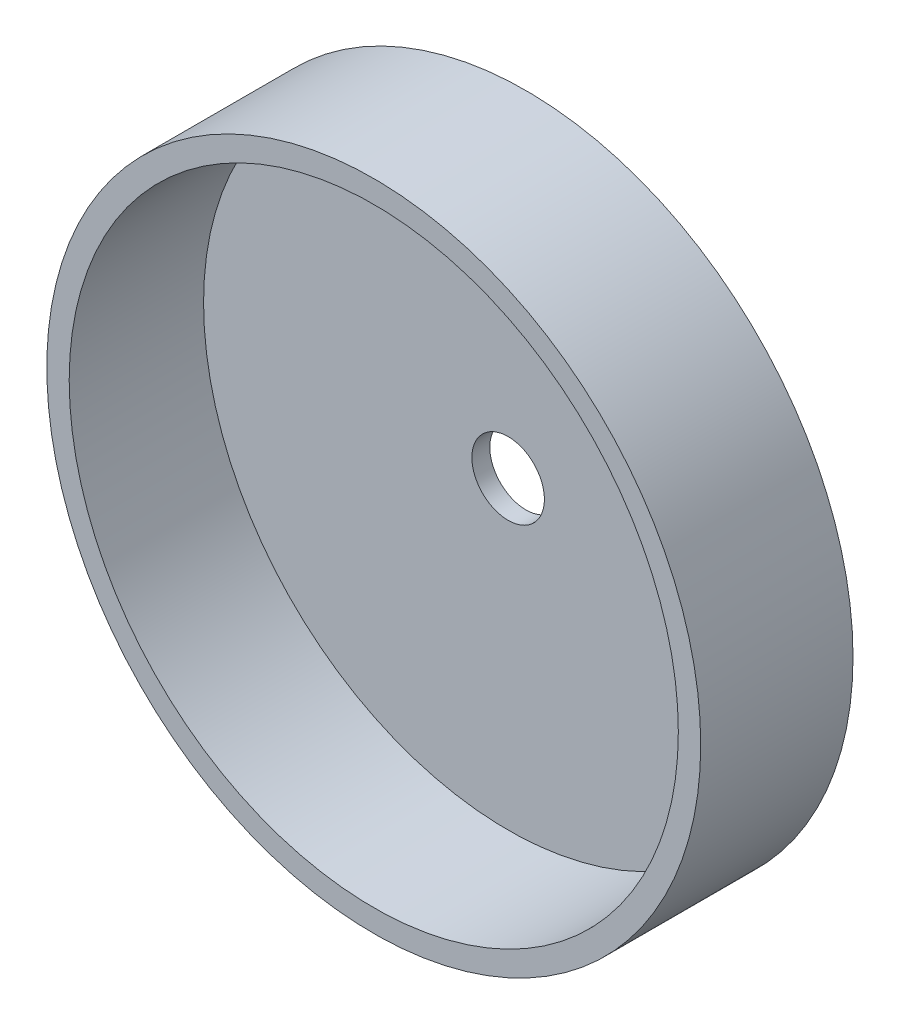
ISO-10303-21;
HEADER;
FILE_DESCRIPTION(('STEP AP214'),'2;1');
FILE_NAME('part.step','',(''),(''),'','','');
FILE_SCHEMA(('AUTOMOTIVE_DESIGN { 1 0 10303 214 1 1 1 1 }'));
ENDSEC;
DATA;
#1=APPLICATION_CONTEXT('core data for automotive mechanical design processes');
#2=APPLICATION_PROTOCOL_DEFINITION('international standard','automotive_design',2000,#1);
#3=PRODUCT_CONTEXT('',#1,'mechanical');
#4=PRODUCT('Part','Part','',(#3));
#5=PRODUCT_RELATED_PRODUCT_CATEGORY('part','',(#4));
#6=PRODUCT_DEFINITION_FORMATION('','',#4);
#7=PRODUCT_DEFINITION_CONTEXT('part definition',#1,'design');
#8=PRODUCT_DEFINITION('design','',#6,#7);
#9=PRODUCT_DEFINITION_SHAPE('','',#8);
#10=(LENGTH_UNIT() NAMED_UNIT(*) SI_UNIT(.MILLI.,.METRE.));
#11=(NAMED_UNIT(*) PLANE_ANGLE_UNIT() SI_UNIT($,.RADIAN.));
#12=(NAMED_UNIT(*) SI_UNIT($,.STERADIAN.) SOLID_ANGLE_UNIT());
#13=UNCERTAINTY_MEASURE_WITH_UNIT(LENGTH_MEASURE(1.E-05),#10,'distance_accuracy_value','');
#14=(GEOMETRIC_REPRESENTATION_CONTEXT(3) GLOBAL_UNCERTAINTY_ASSIGNED_CONTEXT((#13)) GLOBAL_UNIT_ASSIGNED_CONTEXT((#10,
#11,#12)) REPRESENTATION_CONTEXT('',''));
#15=CARTESIAN_POINT('',(0.,0.,0.));
#16=DIRECTION('',(0.,0.,1.));
#17=DIRECTION('',(1.,0.,0.));
#18=AXIS2_PLACEMENT_3D('',#15,#16,#17);
#19=CARTESIAN_POINT('',(0.,0.,2.));
#20=DIRECTION('',(0.,0.,1.));
#21=DIRECTION('',(1.,0.,0.));
#22=AXIS2_PLACEMENT_3D('',#19,#20,#21);
#23=PLANE('',#22);
#24=CARTESIAN_POINT('',(0.,0.,2.));
#25=DIRECTION('',(0.,0.,1.));
#26=DIRECTION('',(1.,0.,0.));
#27=AXIS2_PLACEMENT_3D('',#24,#25,#26);
#28=CIRCLE('',#27,4.05);
#29=CARTESIAN_POINT('',(4.05,0.,2.));
#30=VERTEX_POINT('',#29);
#31=EDGE_CURVE('E51',#30,#30,#28,.T.);
#32=ORIENTED_EDGE('',*,*,#31,.F.);
#33=EDGE_LOOP('',(#32));
#34=FACE_BOUND('',#33,.T.);
#35=CARTESIAN_POINT('',(0.,0.,2.));
#36=DIRECTION('',(0.,0.,1.));
#37=DIRECTION('',(1.,0.,0.));
#38=AXIS2_PLACEMENT_3D('',#35,#36,#37);
#39=CIRCLE('',#38,34.);
#40=CARTESIAN_POINT('',(34.,0.,2.));
#41=VERTEX_POINT('',#40);
#42=EDGE_CURVE('E10',#41,#41,#39,.T.);
#43=ORIENTED_EDGE('',*,*,#42,.T.);
#44=EDGE_LOOP('',(#43));
#45=FACE_BOUND('',#44,.T.);
#46=ADVANCED_FACE('F31',(#34,#45),#23,.T.);
#47=CARTESIAN_POINT('',(0.,0.,-103.237590053236));
#48=DIRECTION('',(0.,0.,1.));
#49=DIRECTION('',(1.,0.,0.));
#50=AXIS2_PLACEMENT_3D('',#47,#48,#49);
#51=CYLINDRICAL_SURFACE('',#50,36.5);
#52=CARTESIAN_POINT('',(0.,0.,0.));
#53=DIRECTION('',(0.,0.,1.));
#54=DIRECTION('',(1.,0.,0.));
#55=AXIS2_PLACEMENT_3D('',#52,#53,#54);
#56=CIRCLE('',#55,36.5);
#57=CARTESIAN_POINT('',(36.5,0.,0.));
#58=VERTEX_POINT('',#57);
#59=EDGE_CURVE('E38',#58,#58,#56,.F.);
#60=ORIENTED_EDGE('',*,*,#59,.F.);
#61=EDGE_LOOP('',(#60));
#62=FACE_BOUND('',#61,.T.);
#63=CARTESIAN_POINT('',(0.,0.,17.));
#64=DIRECTION('',(0.,0.,1.));
#65=DIRECTION('',(1.,0.,0.));
#66=AXIS2_PLACEMENT_3D('',#63,#64,#65);
#67=CIRCLE('',#66,36.5);
#68=CARTESIAN_POINT('',(36.5,0.,17.));
#69=VERTEX_POINT('',#68);
#70=EDGE_CURVE('E42',#69,#69,#67,.T.);
#71=ORIENTED_EDGE('',*,*,#70,.F.);
#72=EDGE_LOOP('',(#71));
#73=FACE_BOUND('',#72,.T.);
#74=ADVANCED_FACE('F70',(#62,#73),#51,.T.);
#75=CARTESIAN_POINT('',(0.,0.,-103.237590053236));
#76=DIRECTION('',(0.,0.,1.));
#77=DIRECTION('',(1.,0.,0.));
#78=AXIS2_PLACEMENT_3D('',#75,#76,#77);
#79=CYLINDRICAL_SURFACE('',#78,34.);
#80=ORIENTED_EDGE('',*,*,#42,.F.);
#81=EDGE_LOOP('',(#80));
#82=FACE_BOUND('',#81,.T.);
#83=CARTESIAN_POINT('',(0.,0.,17.));
#84=DIRECTION('',(0.,0.,1.));
#85=DIRECTION('',(1.,0.,0.));
#86=AXIS2_PLACEMENT_3D('',#83,#84,#85);
#87=CIRCLE('',#86,34.);
#88=CARTESIAN_POINT('',(34.,0.,17.));
#89=VERTEX_POINT('',#88);
#90=EDGE_CURVE('E46',#89,#89,#87,.T.);
#91=ORIENTED_EDGE('',*,*,#90,.T.);
#92=EDGE_LOOP('',(#91));
#93=FACE_BOUND('',#92,.T.);
#94=ADVANCED_FACE('F76',(#82,#93),#79,.F.);
#95=CARTESIAN_POINT('',(0.,0.,17.));
#96=DIRECTION('',(0.,0.,1.));
#97=DIRECTION('',(1.,0.,0.));
#98=AXIS2_PLACEMENT_3D('',#95,#96,#97);
#99=PLANE('',#98);
#100=ORIENTED_EDGE('',*,*,#70,.T.);
#101=EDGE_LOOP('',(#100));
#102=FACE_BOUND('',#101,.T.);
#103=ORIENTED_EDGE('',*,*,#90,.F.);
#104=EDGE_LOOP('',(#103));
#105=FACE_BOUND('',#104,.T.);
#106=ADVANCED_FACE('F67',(#102,#105),#99,.T.);
#107=CARTESIAN_POINT('',(0.,0.,0.));
#108=DIRECTION('',(0.,0.,1.));
#109=DIRECTION('',(1.,0.,0.));
#110=AXIS2_PLACEMENT_3D('',#107,#108,#109);
#111=PLANE('',#110);
#112=CARTESIAN_POINT('',(0.,0.,0.));
#113=DIRECTION('',(0.,0.,1.));
#114=DIRECTION('',(1.,0.,0.));
#115=AXIS2_PLACEMENT_3D('',#112,#113,#114);
#116=CIRCLE('',#115,4.05);
#117=CARTESIAN_POINT('',(4.05,0.,0.));
#118=VERTEX_POINT('',#117);
#119=EDGE_CURVE('E54',#118,#118,#116,.T.);
#120=ORIENTED_EDGE('',*,*,#119,.T.);
#121=EDGE_LOOP('',(#120));
#122=FACE_BOUND('',#121,.T.);
#123=ORIENTED_EDGE('',*,*,#59,.T.);
#124=EDGE_LOOP('',(#123));
#125=FACE_BOUND('',#124,.T.);
#126=ADVANCED_FACE('F33',(#122,#125),#111,.F.);
#127=CARTESIAN_POINT('',(0.,0.,0.));
#128=DIRECTION('',(0.,0.,1.));
#129=DIRECTION('',(1.,0.,0.));
#130=AXIS2_PLACEMENT_3D('',#127,#128,#129);
#131=CYLINDRICAL_SURFACE('',#130,4.05);
#132=ORIENTED_EDGE('',*,*,#31,.T.);
#133=EDGE_LOOP('',(#132));
#134=FACE_BOUND('',#133,.T.);
#135=ORIENTED_EDGE('',*,*,#119,.F.);
#136=EDGE_LOOP('',(#135));
#137=FACE_BOUND('',#136,.T.);
#138=ADVANCED_FACE('F59',(#134,#137),#131,.F.);
#139=CLOSED_SHELL('',(#46,#74,#94,#106,#126,#138));
#140=MANIFOLD_SOLID_BREP('B2',#139);
#141=ADVANCED_BREP_SHAPE_REPRESENTATION('',(#18,#140),#14);
#142=SHAPE_DEFINITION_REPRESENTATION(#9,#141);
ENDSEC;
END-ISO-10303-21;
